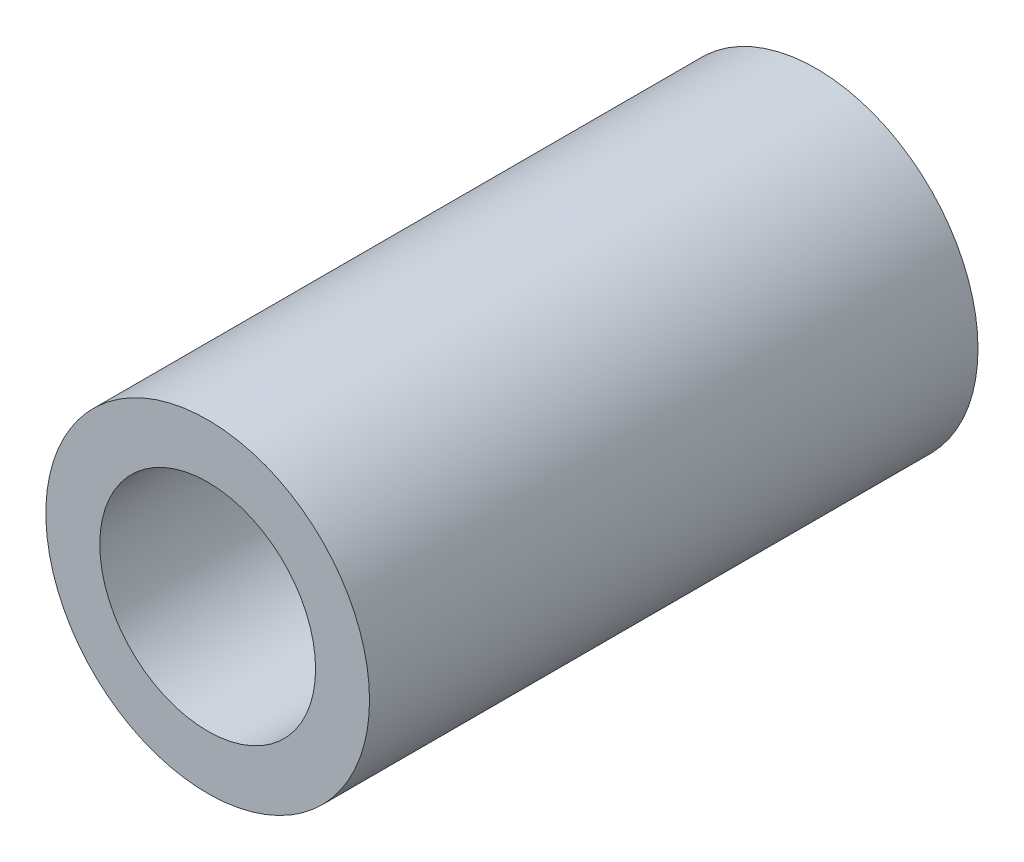
ISO-10303-21;
HEADER;
FILE_DESCRIPTION(('STEP AP214'),'2;1');
FILE_NAME('part.step','',(''),(''),'','','');
FILE_SCHEMA(('AUTOMOTIVE_DESIGN { 1 0 10303 214 1 1 1 1 }'));
ENDSEC;
DATA;
#1=APPLICATION_CONTEXT('core data for automotive mechanical design processes');
#2=APPLICATION_PROTOCOL_DEFINITION('international standard','automotive_design',2000,#1);
#3=PRODUCT_CONTEXT('',#1,'mechanical');
#4=PRODUCT('Part','Part','',(#3));
#5=PRODUCT_RELATED_PRODUCT_CATEGORY('part','',(#4));
#6=PRODUCT_DEFINITION_FORMATION('','',#4);
#7=PRODUCT_DEFINITION_CONTEXT('part definition',#1,'design');
#8=PRODUCT_DEFINITION('design','',#6,#7);
#9=PRODUCT_DEFINITION_SHAPE('','',#8);
#10=(LENGTH_UNIT() NAMED_UNIT(*) SI_UNIT(.MILLI.,.METRE.));
#11=(NAMED_UNIT(*) PLANE_ANGLE_UNIT() SI_UNIT($,.RADIAN.));
#12=(NAMED_UNIT(*) SI_UNIT($,.STERADIAN.) SOLID_ANGLE_UNIT());
#13=UNCERTAINTY_MEASURE_WITH_UNIT(LENGTH_MEASURE(1.E-05),#10,'distance_accuracy_value','');
#14=(GEOMETRIC_REPRESENTATION_CONTEXT(3) GLOBAL_UNCERTAINTY_ASSIGNED_CONTEXT((#13)) GLOBAL_UNIT_ASSIGNED_CONTEXT((#10,
#11,#12)) REPRESENTATION_CONTEXT('',''));
#15=CARTESIAN_POINT('',(0.,0.,0.));
#16=DIRECTION('',(0.,0.,1.));
#17=DIRECTION('',(1.,0.,0.));
#18=AXIS2_PLACEMENT_3D('',#15,#16,#17);
#19=CARTESIAN_POINT('',(0.,0.,71.628));
#20=DIRECTION('',(0.,0.,1.));
#21=DIRECTION('',(1.,0.,0.));
#22=AXIS2_PLACEMENT_3D('',#19,#20,#21);
#23=PLANE('',#22);
#24=CARTESIAN_POINT('',(0.,0.,71.628));
#25=DIRECTION('',(0.,0.,1.));
#26=DIRECTION('',(1.,0.,0.));
#27=AXIS2_PLACEMENT_3D('',#24,#25,#26);
#28=CIRCLE('',#27,19.05);
#29=CARTESIAN_POINT('',(19.05,0.,71.628));
#30=VERTEX_POINT('',#29);
#31=EDGE_CURVE('E10',#30,#30,#28,.T.);
#32=ORIENTED_EDGE('',*,*,#31,.T.);
#33=EDGE_LOOP('',(#32));
#34=FACE_BOUND('',#33,.T.);
#35=CARTESIAN_POINT('',(0.,0.,71.628));
#36=DIRECTION('',(0.,0.,1.));
#37=DIRECTION('',(1.,0.,0.));
#38=AXIS2_PLACEMENT_3D('',#35,#36,#37);
#39=CIRCLE('',#38,12.7);
#40=CARTESIAN_POINT('',(12.7,0.,71.628));
#41=VERTEX_POINT('',#40);
#42=EDGE_CURVE('E42',#41,#41,#39,.T.);
#43=ORIENTED_EDGE('',*,*,#42,.F.);
#44=EDGE_LOOP('',(#43));
#45=FACE_BOUND('',#44,.T.);
#46=ADVANCED_FACE('F31',(#34,#45),#23,.T.);
#47=CARTESIAN_POINT('',(0.,0.,0.));
#48=DIRECTION('',(0.,0.,1.));
#49=DIRECTION('',(1.,0.,0.));
#50=AXIS2_PLACEMENT_3D('',#47,#48,#49);
#51=PLANE('',#50);
#52=CARTESIAN_POINT('',(0.,0.,0.));
#53=DIRECTION('',(0.,0.,1.));
#54=DIRECTION('',(1.,0.,0.));
#55=AXIS2_PLACEMENT_3D('',#52,#53,#54);
#56=CIRCLE('',#55,19.05);
#57=CARTESIAN_POINT('',(19.05,0.,0.));
#58=VERTEX_POINT('',#57);
#59=EDGE_CURVE('E35',#58,#58,#56,.T.);
#60=ORIENTED_EDGE('',*,*,#59,.F.);
#61=EDGE_LOOP('',(#60));
#62=FACE_BOUND('',#61,.T.);
#63=CARTESIAN_POINT('',(0.,0.,0.));
#64=DIRECTION('',(0.,0.,1.));
#65=DIRECTION('',(1.,0.,0.));
#66=AXIS2_PLACEMENT_3D('',#63,#64,#65);
#67=CIRCLE('',#66,12.7);
#68=CARTESIAN_POINT('',(12.7,0.,0.));
#69=VERTEX_POINT('',#68);
#70=EDGE_CURVE('E44',#69,#69,#67,.T.);
#71=ORIENTED_EDGE('',*,*,#70,.T.);
#72=EDGE_LOOP('',(#71));
#73=FACE_BOUND('',#72,.T.);
#74=ADVANCED_FACE('F54',(#62,#73),#51,.F.);
#75=CARTESIAN_POINT('',(0.,0.,71.628));
#76=DIRECTION('',(0.,0.,-1.));
#77=DIRECTION('',(-1.,0.,0.));
#78=AXIS2_PLACEMENT_3D('',#75,#76,#77);
#79=CYLINDRICAL_SURFACE('',#78,19.05);
#80=ORIENTED_EDGE('',*,*,#31,.F.);
#81=EDGE_LOOP('',(#80));
#82=FACE_BOUND('',#81,.T.);
#83=ORIENTED_EDGE('',*,*,#59,.T.);
#84=EDGE_LOOP('',(#83));
#85=FACE_BOUND('',#84,.T.);
#86=ADVANCED_FACE('F33',(#82,#85),#79,.T.);
#87=CARTESIAN_POINT('',(0.,0.,71.628));
#88=DIRECTION('',(0.,0.,-1.));
#89=DIRECTION('',(-1.,0.,0.));
#90=AXIS2_PLACEMENT_3D('',#87,#88,#89);
#91=CYLINDRICAL_SURFACE('',#90,12.7);
#92=ORIENTED_EDGE('',*,*,#42,.T.);
#93=EDGE_LOOP('',(#92));
#94=FACE_BOUND('',#93,.T.);
#95=ORIENTED_EDGE('',*,*,#70,.F.);
#96=EDGE_LOOP('',(#95));
#97=FACE_BOUND('',#96,.T.);
#98=ADVANCED_FACE('F50',(#94,#97),#91,.F.);
#99=CLOSED_SHELL('',(#46,#74,#86,#98));
#100=MANIFOLD_SOLID_BREP('B2',#99);
#101=ADVANCED_BREP_SHAPE_REPRESENTATION('',(#18,#100),#14);
#102=SHAPE_DEFINITION_REPRESENTATION(#9,#101);
ENDSEC;
END-ISO-10303-21;
